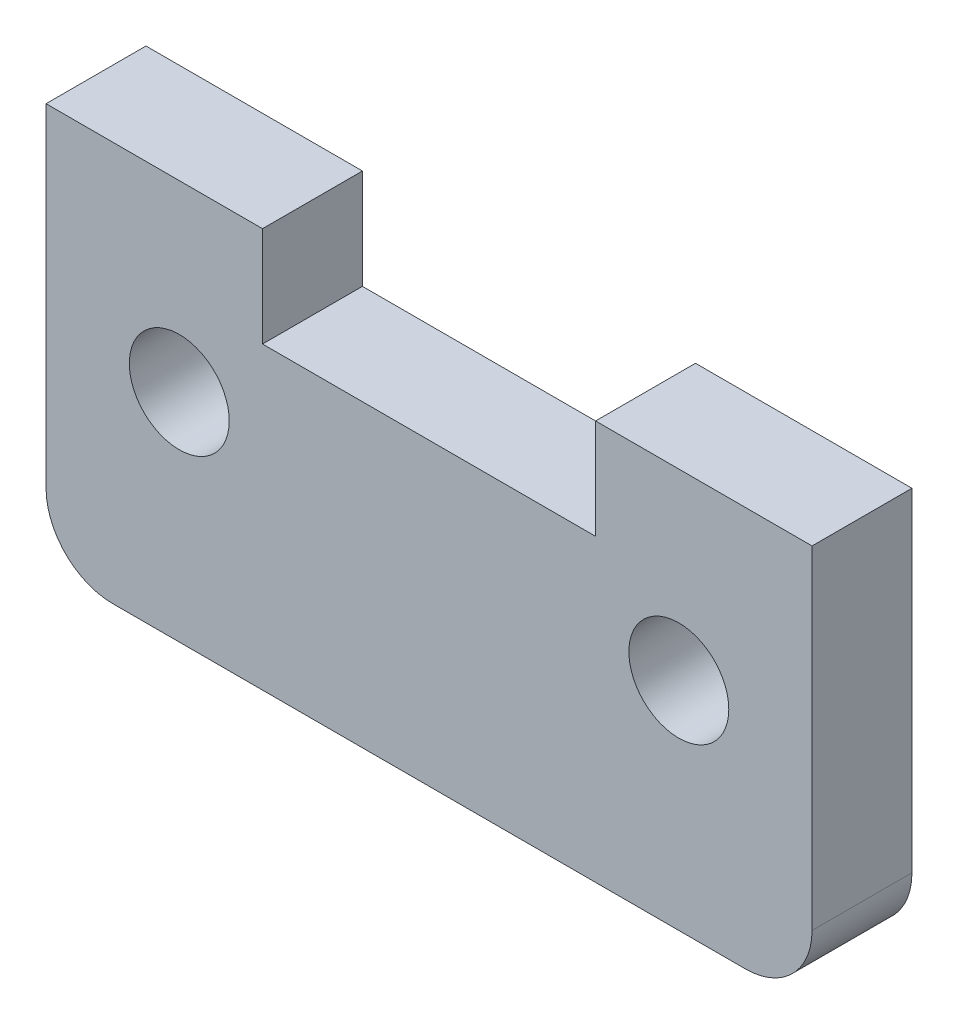
ISO-10303-21;
HEADER;
FILE_DESCRIPTION(('STEP AP214'),'2;1');
FILE_NAME('part.step','',(''),(''),'','','');
FILE_SCHEMA(('AUTOMOTIVE_DESIGN { 1 0 10303 214 1 1 1 1 }'));
ENDSEC;
DATA;
#1=APPLICATION_CONTEXT('core data for automotive mechanical design processes');
#2=APPLICATION_PROTOCOL_DEFINITION('international standard','automotive_design',2000,#1);
#3=PRODUCT_CONTEXT('',#1,'mechanical');
#4=PRODUCT('Part','Part','',(#3));
#5=PRODUCT_RELATED_PRODUCT_CATEGORY('part','',(#4));
#6=PRODUCT_DEFINITION_FORMATION('','',#4);
#7=PRODUCT_DEFINITION_CONTEXT('part definition',#1,'design');
#8=PRODUCT_DEFINITION('design','',#6,#7);
#9=PRODUCT_DEFINITION_SHAPE('','',#8);
#10=(LENGTH_UNIT() NAMED_UNIT(*) SI_UNIT(.MILLI.,.METRE.));
#11=(NAMED_UNIT(*) PLANE_ANGLE_UNIT() SI_UNIT($,.RADIAN.));
#12=(NAMED_UNIT(*) SI_UNIT($,.STERADIAN.) SOLID_ANGLE_UNIT());
#13=UNCERTAINTY_MEASURE_WITH_UNIT(LENGTH_MEASURE(1.E-05),#10,'distance_accuracy_value','');
#14=(GEOMETRIC_REPRESENTATION_CONTEXT(3) GLOBAL_UNCERTAINTY_ASSIGNED_CONTEXT((#13)) GLOBAL_UNIT_ASSIGNED_CONTEXT((#10,
#11,#12)) REPRESENTATION_CONTEXT('',''));
#15=CARTESIAN_POINT('',(0.,0.,0.));
#16=DIRECTION('',(0.,0.,1.));
#17=DIRECTION('',(1.,0.,0.));
#18=AXIS2_PLACEMENT_3D('',#15,#16,#17);
#19=CARTESIAN_POINT('',(-14.822941476578,-4.41189019470167,3.));
#20=DIRECTION('',(0.,0.,1.));
#21=DIRECTION('',(1.,0.,0.));
#22=AXIS2_PLACEMENT_3D('',#19,#20,#21);
#23=PLANE('',#22);
#24=CARTESIAN_POINT('',(-12.822941476578,0.0881098052983344,3.));
#25=DIRECTION('',(0.,0.,1.));
#26=DIRECTION('',(1.,0.,0.));
#27=AXIS2_PLACEMENT_3D('',#24,#25,#26);
#28=CIRCLE('',#27,1.5);
#29=CARTESIAN_POINT('',(-11.322941476578,0.0881098052983344,3.));
#30=VERTEX_POINT('',#29);
#31=EDGE_CURVE('E145',#30,#30,#28,.T.);
#32=ORIENTED_EDGE('',*,*,#31,.F.);
#33=EDGE_LOOP('',(#32));
#34=FACE_BOUND('',#33,.T.);
#35=DIRECTION('',(0.,-1.,0.));
#36=VECTOR('',#35,1.);
#37=CARTESIAN_POINT('',(-16.822941476578,5.58810980529833,3.));
#38=LINE('',#37,#36);
#39=CARTESIAN_POINT('',(-16.822941476578,5.58810980529833,3.));
#40=VERTEX_POINT('',#39);
#41=CARTESIAN_POINT('',(-16.822941476578,-4.41189019470165,3.));
#42=VERTEX_POINT('',#41);
#43=EDGE_CURVE('E160',#40,#42,#38,.T.);
#44=ORIENTED_EDGE('',*,*,#43,.T.);
#45=CARTESIAN_POINT('',(-14.822941476578,-4.41189019470167,3.));
#46=DIRECTION('',(0.,0.,1.));
#47=DIRECTION('',(1.,0.,0.));
#48=AXIS2_PLACEMENT_3D('',#45,#46,#47);
#49=CIRCLE('',#48,2.);
#50=CARTESIAN_POINT('',(-14.822941476578,-6.41189019470167,3.));
#51=VERTEX_POINT('',#50);
#52=EDGE_CURVE('E98',#42,#51,#49,.T.);
#53=ORIENTED_EDGE('',*,*,#52,.T.);
#54=DIRECTION('',(1.,0.,0.));
#55=VECTOR('',#54,1.);
#56=CARTESIAN_POINT('',(-14.822941476578,-6.41189019470167,3.));
#57=LINE('',#56,#55);
#58=CARTESIAN_POINT('',(4.17705852342201,-6.41189019470167,3.));
#59=VERTEX_POINT('',#58);
#60=EDGE_CURVE('E181',#51,#59,#57,.T.);
#61=ORIENTED_EDGE('',*,*,#60,.T.);
#62=CARTESIAN_POINT('',(4.17705852342202,-4.41189019470167,3.));
#63=DIRECTION('',(0.,0.,1.));
#64=DIRECTION('',(1.,0.,0.));
#65=AXIS2_PLACEMENT_3D('',#62,#63,#64);
#66=CIRCLE('',#65,2.);
#67=CARTESIAN_POINT('',(6.17705852342202,-4.41189019470165,3.));
#68=VERTEX_POINT('',#67);
#69=EDGE_CURVE('E200',#59,#68,#66,.T.);
#70=ORIENTED_EDGE('',*,*,#69,.T.);
#71=DIRECTION('',(0.,1.,0.));
#72=VECTOR('',#71,1.);
#73=CARTESIAN_POINT('',(6.17705852342202,5.58810980529833,3.));
#74=LINE('',#73,#72);
#75=CARTESIAN_POINT('',(6.17705852342202,5.58810980529833,3.));
#76=VERTEX_POINT('',#75);
#77=EDGE_CURVE('E197',#68,#76,#74,.T.);
#78=ORIENTED_EDGE('',*,*,#77,.T.);
#79=DIRECTION('',(-1.,0.,0.));
#80=VECTOR('',#79,1.);
#81=CARTESIAN_POINT('',(-0.322941476577982,5.58810980529833,3.));
#82=LINE('',#81,#80);
#83=CARTESIAN_POINT('',(-0.322941476577982,5.58810980529833,3.));
#84=VERTEX_POINT('',#83);
#85=EDGE_CURVE('E199',#76,#84,#82,.T.);
#86=ORIENTED_EDGE('',*,*,#85,.T.);
#87=DIRECTION('',(0.,-1.,0.));
#88=VECTOR('',#87,1.);
#89=CARTESIAN_POINT('',(-0.322941476577982,2.58810980529833,3.));
#90=LINE('',#89,#88);
#91=CARTESIAN_POINT('',(-0.322941476577982,2.58810980529833,3.));
#92=VERTEX_POINT('',#91);
#93=EDGE_CURVE('E123',#84,#92,#90,.T.);
#94=ORIENTED_EDGE('',*,*,#93,.T.);
#95=DIRECTION('',(-1.,0.,0.));
#96=VECTOR('',#95,1.);
#97=CARTESIAN_POINT('',(-10.322941476578,2.58810980529833,3.));
#98=LINE('',#97,#96);
#99=CARTESIAN_POINT('',(-10.322941476578,2.58810980529833,3.));
#100=VERTEX_POINT('',#99);
#101=EDGE_CURVE('E117',#92,#100,#98,.T.);
#102=ORIENTED_EDGE('',*,*,#101,.T.);
#103=DIRECTION('',(0.,1.,0.));
#104=VECTOR('',#103,1.);
#105=CARTESIAN_POINT('',(-10.322941476578,5.58810980529833,3.));
#106=LINE('',#105,#104);
#107=CARTESIAN_POINT('',(-10.322941476578,5.58810980529833,3.));
#108=VERTEX_POINT('',#107);
#109=EDGE_CURVE('E121',#100,#108,#106,.T.);
#110=ORIENTED_EDGE('',*,*,#109,.T.);
#111=DIRECTION('',(-1.,0.,0.));
#112=VECTOR('',#111,1.);
#113=CARTESIAN_POINT('',(-16.822941476578,5.58810980529833,3.));
#114=LINE('',#113,#112);
#115=EDGE_CURVE('E49',#108,#40,#114,.T.);
#116=ORIENTED_EDGE('',*,*,#115,.T.);
#117=EDGE_LOOP('',(#44,#53,#61,#70,#78,#86,#94,#102,#110,#116));
#118=FACE_BOUND('',#117,.T.);
#119=CARTESIAN_POINT('',(2.17705852342202,0.0881098052983383,3.));
#120=DIRECTION('',(0.,0.,1.));
#121=DIRECTION('',(1.,0.,0.));
#122=AXIS2_PLACEMENT_3D('',#119,#120,#121);
#123=CIRCLE('',#122,1.5);
#124=CARTESIAN_POINT('',(3.67705852342202,0.0881098052983383,3.));
#125=VERTEX_POINT('',#124);
#126=EDGE_CURVE('E211',#125,#125,#123,.T.);
#127=ORIENTED_EDGE('',*,*,#126,.F.);
#128=EDGE_LOOP('',(#127));
#129=FACE_BOUND('',#128,.T.);
#130=ADVANCED_FACE('F32',(#34,#118,#129),#23,.T.);
#131=CARTESIAN_POINT('',(-14.822941476578,-4.41189019470167,0.));
#132=DIRECTION('',(0.,0.,1.));
#133=DIRECTION('',(1.,0.,0.));
#134=AXIS2_PLACEMENT_3D('',#131,#132,#133);
#135=PLANE('',#134);
#136=CARTESIAN_POINT('',(-12.822941476578,0.0881098052983344,0.));
#137=DIRECTION('',(0.,0.,1.));
#138=DIRECTION('',(1.,0.,0.));
#139=AXIS2_PLACEMENT_3D('',#136,#137,#138);
#140=CIRCLE('',#139,1.5);
#141=CARTESIAN_POINT('',(-11.322941476578,0.0881098052983344,0.));
#142=VERTEX_POINT('',#141);
#143=EDGE_CURVE('E208',#142,#142,#140,.T.);
#144=ORIENTED_EDGE('',*,*,#143,.T.);
#145=EDGE_LOOP('',(#144));
#146=FACE_BOUND('',#145,.T.);
#147=DIRECTION('',(0.,-1.,0.));
#148=VECTOR('',#147,1.);
#149=CARTESIAN_POINT('',(-16.822941476578,5.58810980529833,0.));
#150=LINE('',#149,#148);
#151=CARTESIAN_POINT('',(-16.822941476578,5.58810980529833,0.));
#152=VERTEX_POINT('',#151);
#153=CARTESIAN_POINT('',(-16.822941476578,-4.41189019470165,0.));
#154=VERTEX_POINT('',#153);
#155=EDGE_CURVE('E141',#152,#154,#150,.T.);
#156=ORIENTED_EDGE('',*,*,#155,.F.);
#157=DIRECTION('',(-1.,0.,0.));
#158=VECTOR('',#157,1.);
#159=CARTESIAN_POINT('',(-16.822941476578,5.58810980529833,0.));
#160=LINE('',#159,#158);
#161=CARTESIAN_POINT('',(-10.322941476578,5.58810980529833,0.));
#162=VERTEX_POINT('',#161);
#163=EDGE_CURVE('E90',#162,#152,#160,.T.);
#164=ORIENTED_EDGE('',*,*,#163,.F.);
#165=DIRECTION('',(0.,1.,0.));
#166=VECTOR('',#165,1.);
#167=CARTESIAN_POINT('',(-10.322941476578,5.58810980529833,0.));
#168=LINE('',#167,#166);
#169=CARTESIAN_POINT('',(-10.322941476578,2.58810980529833,0.));
#170=VERTEX_POINT('',#169);
#171=EDGE_CURVE('E84',#170,#162,#168,.T.);
#172=ORIENTED_EDGE('',*,*,#171,.F.);
#173=DIRECTION('',(-1.,0.,0.));
#174=VECTOR('',#173,1.);
#175=CARTESIAN_POINT('',(-10.322941476578,2.58810980529833,0.));
#176=LINE('',#175,#174);
#177=CARTESIAN_POINT('',(-0.322941476577982,2.58810980529833,0.));
#178=VERTEX_POINT('',#177);
#179=EDGE_CURVE('E131',#178,#170,#176,.T.);
#180=ORIENTED_EDGE('',*,*,#179,.F.);
#181=DIRECTION('',(0.,-1.,0.));
#182=VECTOR('',#181,1.);
#183=CARTESIAN_POINT('',(-0.322941476577982,2.58810980529833,0.));
#184=LINE('',#183,#182);
#185=CARTESIAN_POINT('',(-0.322941476577982,5.58810980529833,0.));
#186=VERTEX_POINT('',#185);
#187=EDGE_CURVE('E155',#186,#178,#184,.T.);
#188=ORIENTED_EDGE('',*,*,#187,.F.);
#189=DIRECTION('',(-1.,0.,0.));
#190=VECTOR('',#189,1.);
#191=CARTESIAN_POINT('',(-0.322941476577982,5.58810980529833,0.));
#192=LINE('',#191,#190);
#193=CARTESIAN_POINT('',(6.17705852342202,5.58810980529833,0.));
#194=VERTEX_POINT('',#193);
#195=EDGE_CURVE('E153',#194,#186,#192,.T.);
#196=ORIENTED_EDGE('',*,*,#195,.F.);
#197=DIRECTION('',(0.,1.,0.));
#198=VECTOR('',#197,1.);
#199=CARTESIAN_POINT('',(6.17705852342202,5.58810980529833,0.));
#200=LINE('',#199,#198);
#201=CARTESIAN_POINT('',(6.17705852342202,-4.41189019470165,0.));
#202=VERTEX_POINT('',#201);
#203=EDGE_CURVE('E151',#202,#194,#200,.T.);
#204=ORIENTED_EDGE('',*,*,#203,.F.);
#205=CARTESIAN_POINT('',(4.17705852342202,-4.41189019470167,0.));
#206=DIRECTION('',(0.,0.,1.));
#207=DIRECTION('',(1.,0.,0.));
#208=AXIS2_PLACEMENT_3D('',#205,#206,#207);
#209=CIRCLE('',#208,2.);
#210=CARTESIAN_POINT('',(4.17705852342201,-6.41189019470167,0.));
#211=VERTEX_POINT('',#210);
#212=EDGE_CURVE('E149',#211,#202,#209,.T.);
#213=ORIENTED_EDGE('',*,*,#212,.F.);
#214=DIRECTION('',(1.,0.,0.));
#215=VECTOR('',#214,1.);
#216=CARTESIAN_POINT('',(-14.822941476578,-6.41189019470167,0.));
#217=LINE('',#216,#215);
#218=CARTESIAN_POINT('',(-14.822941476578,-6.41189019470167,0.));
#219=VERTEX_POINT('',#218);
#220=EDGE_CURVE('E147',#219,#211,#217,.T.);
#221=ORIENTED_EDGE('',*,*,#220,.F.);
#222=CARTESIAN_POINT('',(-14.822941476578,-4.41189019470167,0.));
#223=DIRECTION('',(0.,0.,1.));
#224=DIRECTION('',(1.,0.,0.));
#225=AXIS2_PLACEMENT_3D('',#222,#223,#224);
#226=CIRCLE('',#225,2.);
#227=EDGE_CURVE('E144',#154,#219,#226,.T.);
#228=ORIENTED_EDGE('',*,*,#227,.F.);
#229=EDGE_LOOP('',(#156,#164,#172,#180,#188,#196,#204,#213,#221,#228));
#230=FACE_BOUND('',#229,.T.);
#231=CARTESIAN_POINT('',(2.17705852342202,0.0881098052983383,0.));
#232=DIRECTION('',(0.,0.,1.));
#233=DIRECTION('',(1.,0.,0.));
#234=AXIS2_PLACEMENT_3D('',#231,#232,#233);
#235=CIRCLE('',#234,1.5);
#236=CARTESIAN_POINT('',(3.67705852342202,0.0881098052983383,0.));
#237=VERTEX_POINT('',#236);
#238=EDGE_CURVE('E214',#237,#237,#235,.T.);
#239=ORIENTED_EDGE('',*,*,#238,.T.);
#240=EDGE_LOOP('',(#239));
#241=FACE_BOUND('',#240,.T.);
#242=ADVANCED_FACE('F185',(#146,#230,#241),#135,.F.);
#243=CARTESIAN_POINT('',(-16.822941476578,5.58810980529833,3.));
#244=DIRECTION('',(1.,0.,0.));
#245=DIRECTION('',(0.,1.,0.));
#246=AXIS2_PLACEMENT_3D('',#243,#244,#245);
#247=PLANE('',#246);
#248=ORIENTED_EDGE('',*,*,#155,.T.);
#249=DIRECTION('',(0.,0.,-1.));
#250=VECTOR('',#249,1.);
#251=CARTESIAN_POINT('',(-16.822941476578,-4.41189019470165,3.));
#252=LINE('',#251,#250);
#253=EDGE_CURVE('E11',#42,#154,#252,.T.);
#254=ORIENTED_EDGE('',*,*,#253,.F.);
#255=ORIENTED_EDGE('',*,*,#43,.F.);
#256=DIRECTION('',(0.,0.,-1.));
#257=VECTOR('',#256,1.);
#258=CARTESIAN_POINT('',(-16.822941476578,5.58810980529833,3.));
#259=LINE('',#258,#257);
#260=EDGE_CURVE('E137',#40,#152,#259,.T.);
#261=ORIENTED_EDGE('',*,*,#260,.T.);
#262=EDGE_LOOP('',(#248,#254,#255,#261));
#263=FACE_BOUND('',#262,.T.);
#264=ADVANCED_FACE('F34',(#263),#247,.F.);
#265=CARTESIAN_POINT('',(-14.822941476578,-4.41189019470167,3.));
#266=DIRECTION('',(0.,0.,-1.));
#267=DIRECTION('',(-1.,0.,0.));
#268=AXIS2_PLACEMENT_3D('',#265,#266,#267);
#269=CYLINDRICAL_SURFACE('',#268,2.);
#270=ORIENTED_EDGE('',*,*,#227,.T.);
#271=DIRECTION('',(0.,0.,-1.));
#272=VECTOR('',#271,1.);
#273=CARTESIAN_POINT('',(-14.822941476578,-6.41189019470167,3.));
#274=LINE('',#273,#272);
#275=EDGE_CURVE('E41',#51,#219,#274,.T.);
#276=ORIENTED_EDGE('',*,*,#275,.F.);
#277=ORIENTED_EDGE('',*,*,#52,.F.);
#278=ORIENTED_EDGE('',*,*,#253,.T.);
#279=EDGE_LOOP('',(#270,#276,#277,#278));
#280=FACE_BOUND('',#279,.T.);
#281=ADVANCED_FACE('F255',(#280),#269,.T.);
#282=CARTESIAN_POINT('',(-14.822941476578,-6.41189019470167,3.));
#283=DIRECTION('',(0.,1.,0.));
#284=DIRECTION('',(0.,0.,1.));
#285=AXIS2_PLACEMENT_3D('',#282,#283,#284);
#286=PLANE('',#285);
#287=ORIENTED_EDGE('',*,*,#220,.T.);
#288=DIRECTION('',(0.,0.,-1.));
#289=VECTOR('',#288,1.);
#290=CARTESIAN_POINT('',(4.17705852342201,-6.41189019470167,3.));
#291=LINE('',#290,#289);
#292=EDGE_CURVE('E173',#59,#211,#291,.T.);
#293=ORIENTED_EDGE('',*,*,#292,.F.);
#294=ORIENTED_EDGE('',*,*,#60,.F.);
#295=ORIENTED_EDGE('',*,*,#275,.T.);
#296=EDGE_LOOP('',(#287,#293,#294,#295));
#297=FACE_BOUND('',#296,.T.);
#298=ADVANCED_FACE('F179',(#297),#286,.F.);
#299=CARTESIAN_POINT('',(4.17705852342202,-4.41189019470167,3.));
#300=DIRECTION('',(0.,0.,-1.));
#301=DIRECTION('',(-1.,0.,0.));
#302=AXIS2_PLACEMENT_3D('',#299,#300,#301);
#303=CYLINDRICAL_SURFACE('',#302,2.);
#304=ORIENTED_EDGE('',*,*,#212,.T.);
#305=DIRECTION('',(0.,0.,-1.));
#306=VECTOR('',#305,1.);
#307=CARTESIAN_POINT('',(6.17705852342202,-4.41189019470165,3.));
#308=LINE('',#307,#306);
#309=EDGE_CURVE('E170',#68,#202,#308,.T.);
#310=ORIENTED_EDGE('',*,*,#309,.F.);
#311=ORIENTED_EDGE('',*,*,#69,.F.);
#312=ORIENTED_EDGE('',*,*,#292,.T.);
#313=EDGE_LOOP('',(#304,#310,#311,#312));
#314=FACE_BOUND('',#313,.T.);
#315=ADVANCED_FACE('F191',(#314),#303,.T.);
#316=CARTESIAN_POINT('',(6.17705852342202,5.58810980529833,3.));
#317=DIRECTION('',(-1.,0.,0.));
#318=DIRECTION('',(0.,-1.,0.));
#319=AXIS2_PLACEMENT_3D('',#316,#317,#318);
#320=PLANE('',#319);
#321=ORIENTED_EDGE('',*,*,#203,.T.);
#322=DIRECTION('',(0.,0.,-1.));
#323=VECTOR('',#322,1.);
#324=CARTESIAN_POINT('',(6.17705852342202,5.58810980529833,3.));
#325=LINE('',#324,#323);
#326=EDGE_CURVE('E167',#76,#194,#325,.T.);
#327=ORIENTED_EDGE('',*,*,#326,.F.);
#328=ORIENTED_EDGE('',*,*,#77,.F.);
#329=ORIENTED_EDGE('',*,*,#309,.T.);
#330=EDGE_LOOP('',(#321,#327,#328,#329));
#331=FACE_BOUND('',#330,.T.);
#332=ADVANCED_FACE('F195',(#331),#320,.F.);
#333=CARTESIAN_POINT('',(-0.322941476577982,5.58810980529833,3.));
#334=DIRECTION('',(0.,-1.,0.));
#335=DIRECTION('',(0.,0.,-1.));
#336=AXIS2_PLACEMENT_3D('',#333,#334,#335);
#337=PLANE('',#336);
#338=ORIENTED_EDGE('',*,*,#195,.T.);
#339=DIRECTION('',(0.,0.,-1.));
#340=VECTOR('',#339,1.);
#341=CARTESIAN_POINT('',(-0.322941476577982,5.58810980529833,3.));
#342=LINE('',#341,#340);
#343=EDGE_CURVE('E164',#84,#186,#342,.T.);
#344=ORIENTED_EDGE('',*,*,#343,.F.);
#345=ORIENTED_EDGE('',*,*,#85,.F.);
#346=ORIENTED_EDGE('',*,*,#326,.T.);
#347=EDGE_LOOP('',(#338,#344,#345,#346));
#348=FACE_BOUND('',#347,.T.);
#349=ADVANCED_FACE('F245',(#348),#337,.F.);
#350=CARTESIAN_POINT('',(-0.322941476577982,2.58810980529833,3.));
#351=DIRECTION('',(1.,0.,0.));
#352=DIRECTION('',(0.,0.,-1.));
#353=AXIS2_PLACEMENT_3D('',#350,#351,#352);
#354=PLANE('',#353);
#355=ORIENTED_EDGE('',*,*,#187,.T.);
#356=DIRECTION('',(0.,0.,-1.));
#357=VECTOR('',#356,1.);
#358=CARTESIAN_POINT('',(-0.322941476577982,2.58810980529833,3.));
#359=LINE('',#358,#357);
#360=EDGE_CURVE('E132',#92,#178,#359,.T.);
#361=ORIENTED_EDGE('',*,*,#360,.F.);
#362=ORIENTED_EDGE('',*,*,#93,.F.);
#363=ORIENTED_EDGE('',*,*,#343,.T.);
#364=EDGE_LOOP('',(#355,#361,#362,#363));
#365=FACE_BOUND('',#364,.T.);
#366=ADVANCED_FACE('F242',(#365),#354,.F.);
#367=CARTESIAN_POINT('',(-10.322941476578,2.58810980529833,3.));
#368=DIRECTION('',(0.,-1.,0.));
#369=DIRECTION('',(0.,0.,-1.));
#370=AXIS2_PLACEMENT_3D('',#367,#368,#369);
#371=PLANE('',#370);
#372=ORIENTED_EDGE('',*,*,#179,.T.);
#373=DIRECTION('',(0.,0.,-1.));
#374=VECTOR('',#373,1.);
#375=CARTESIAN_POINT('',(-10.322941476578,2.58810980529833,3.));
#376=LINE('',#375,#374);
#377=EDGE_CURVE('E128',#100,#170,#376,.T.);
#378=ORIENTED_EDGE('',*,*,#377,.F.);
#379=ORIENTED_EDGE('',*,*,#101,.F.);
#380=ORIENTED_EDGE('',*,*,#360,.T.);
#381=EDGE_LOOP('',(#372,#378,#379,#380));
#382=FACE_BOUND('',#381,.T.);
#383=ADVANCED_FACE('F129',(#382),#371,.F.);
#384=CARTESIAN_POINT('',(-10.322941476578,5.58810980529833,3.));
#385=DIRECTION('',(-1.,0.,0.));
#386=DIRECTION('',(0.,0.,1.));
#387=AXIS2_PLACEMENT_3D('',#384,#385,#386);
#388=PLANE('',#387);
#389=ORIENTED_EDGE('',*,*,#171,.T.);
#390=DIRECTION('',(0.,0.,-1.));
#391=VECTOR('',#390,1.);
#392=CARTESIAN_POINT('',(-10.322941476578,5.58810980529833,3.));
#393=LINE('',#392,#391);
#394=EDGE_CURVE('E133',#108,#162,#393,.T.);
#395=ORIENTED_EDGE('',*,*,#394,.F.);
#396=ORIENTED_EDGE('',*,*,#109,.F.);
#397=ORIENTED_EDGE('',*,*,#377,.T.);
#398=EDGE_LOOP('',(#389,#395,#396,#397));
#399=FACE_BOUND('',#398,.T.);
#400=ADVANCED_FACE('F135',(#399),#388,.F.);
#401=CARTESIAN_POINT('',(-16.822941476578,5.58810980529833,3.));
#402=DIRECTION('',(0.,-1.,0.));
#403=DIRECTION('',(0.,0.,-1.));
#404=AXIS2_PLACEMENT_3D('',#401,#402,#403);
#405=PLANE('',#404);
#406=ORIENTED_EDGE('',*,*,#163,.T.);
#407=ORIENTED_EDGE('',*,*,#260,.F.);
#408=ORIENTED_EDGE('',*,*,#115,.F.);
#409=ORIENTED_EDGE('',*,*,#394,.T.);
#410=EDGE_LOOP('',(#406,#407,#408,#409));
#411=FACE_BOUND('',#410,.T.);
#412=ADVANCED_FACE('F235',(#411),#405,.F.);
#413=CARTESIAN_POINT('',(-12.822941476578,0.0881098052983344,3.));
#414=DIRECTION('',(0.,0.,-1.));
#415=DIRECTION('',(-1.,0.,0.));
#416=AXIS2_PLACEMENT_3D('',#413,#414,#415);
#417=CYLINDRICAL_SURFACE('',#416,1.5);
#418=ORIENTED_EDGE('',*,*,#31,.T.);
#419=EDGE_LOOP('',(#418));
#420=FACE_BOUND('',#419,.T.);
#421=ORIENTED_EDGE('',*,*,#143,.F.);
#422=EDGE_LOOP('',(#421));
#423=FACE_BOUND('',#422,.T.);
#424=ADVANCED_FACE('F232',(#420,#423),#417,.F.);
#425=CARTESIAN_POINT('',(2.17705852342202,0.0881098052983383,3.));
#426=DIRECTION('',(0.,0.,-1.));
#427=DIRECTION('',(-1.,0.,0.));
#428=AXIS2_PLACEMENT_3D('',#425,#426,#427);
#429=CYLINDRICAL_SURFACE('',#428,1.5);
#430=ORIENTED_EDGE('',*,*,#126,.T.);
#431=EDGE_LOOP('',(#430));
#432=FACE_BOUND('',#431,.T.);
#433=ORIENTED_EDGE('',*,*,#238,.F.);
#434=EDGE_LOOP('',(#433));
#435=FACE_BOUND('',#434,.T.);
#436=ADVANCED_FACE('F220',(#432,#435),#429,.F.);
#437=CLOSED_SHELL('',(#130,#242,#264,#281,#298,#315,#332,#349,#366,#383,#400,#412,#424,#436));
#438=MANIFOLD_SOLID_BREP('B2',#437);
#439=ADVANCED_BREP_SHAPE_REPRESENTATION('',(#18,#438),#14);
#440=SHAPE_DEFINITION_REPRESENTATION(#9,#439);
ENDSEC;
END-ISO-10303-21;
